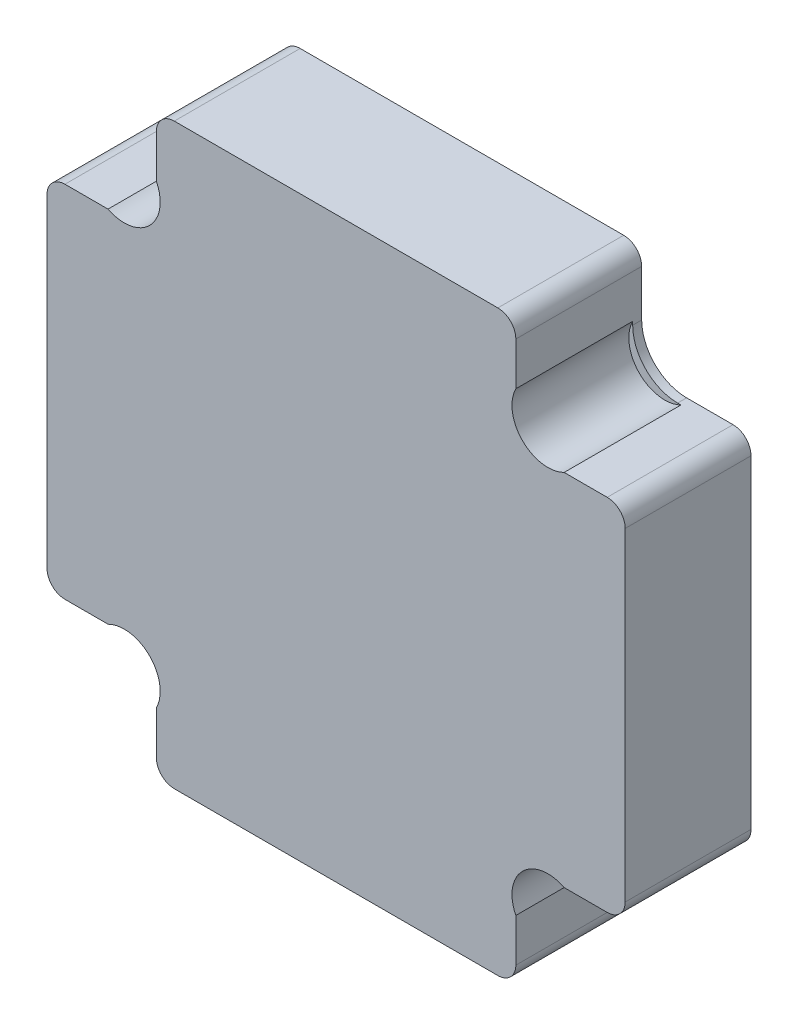
ISO-10303-21;
HEADER;
FILE_DESCRIPTION(('STEP AP214'),'2;1');
FILE_NAME('part.step','',(''),(''),'','','');
FILE_SCHEMA(('AUTOMOTIVE_DESIGN { 1 0 10303 214 1 1 1 1 }'));
ENDSEC;
DATA;
#1=APPLICATION_CONTEXT('core data for automotive mechanical design processes');
#2=APPLICATION_PROTOCOL_DEFINITION('international standard','automotive_design',2000,#1);
#3=PRODUCT_CONTEXT('',#1,'mechanical');
#4=PRODUCT('Part','Part','',(#3));
#5=PRODUCT_RELATED_PRODUCT_CATEGORY('part','',(#4));
#6=PRODUCT_DEFINITION_FORMATION('','',#4);
#7=PRODUCT_DEFINITION_CONTEXT('part definition',#1,'design');
#8=PRODUCT_DEFINITION('design','',#6,#7);
#9=PRODUCT_DEFINITION_SHAPE('','',#8);
#10=(LENGTH_UNIT() NAMED_UNIT(*) SI_UNIT(.MILLI.,.METRE.));
#11=(NAMED_UNIT(*) PLANE_ANGLE_UNIT() SI_UNIT($,.RADIAN.));
#12=(NAMED_UNIT(*) SI_UNIT($,.STERADIAN.) SOLID_ANGLE_UNIT());
#13=UNCERTAINTY_MEASURE_WITH_UNIT(LENGTH_MEASURE(1.E-05),#10,'distance_accuracy_value','');
#14=(GEOMETRIC_REPRESENTATION_CONTEXT(3) GLOBAL_UNCERTAINTY_ASSIGNED_CONTEXT((#13)) GLOBAL_UNIT_ASSIGNED_CONTEXT((#10,
#11,#12)) REPRESENTATION_CONTEXT('',''));
#15=CARTESIAN_POINT('',(0.,0.,0.));
#16=DIRECTION('',(0.,0.,1.));
#17=DIRECTION('',(1.,0.,0.));
#18=AXIS2_PLACEMENT_3D('',#15,#16,#17);
#19=CARTESIAN_POINT('',(0.,0.,-35.5024526321762));
#20=DIRECTION('',(0.,0.,1.));
#21=DIRECTION('',(1.,0.,0.));
#22=AXIS2_PLACEMENT_3D('',#19,#20,#21);
#23=PLANE('',#22);
#24=CARTESIAN_POINT('',(-17.677669529665,17.677669529665,-35.5024526321762));
#25=DIRECTION('',(0.,0.,1.));
#26=DIRECTION('',(1.,0.,0.));
#27=AXIS2_PLACEMENT_3D('',#24,#25,#26);
#28=CIRCLE('',#27,3.);
#29=CARTESIAN_POINT('',(-19.0304762009631,15.,-35.5024526321762));
#30=VERTEX_POINT('',#29);
#31=CARTESIAN_POINT('',(-15.,19.0304762009631,-35.5024526321762));
#32=VERTEX_POINT('',#31);
#33=EDGE_CURVE('E41',#30,#32,#28,.T.);
#34=ORIENTED_EDGE('',*,*,#33,.T.);
#35=DIRECTION('',(0.,1.,0.));
#36=VECTOR('',#35,1.);
#37=CARTESIAN_POINT('',(-15.,24.125,-35.5024526321762));
#38=LINE('',#37,#36);
#39=CARTESIAN_POINT('',(-15.,18.75,-35.5024526321762));
#40=VERTEX_POINT('',#39);
#41=EDGE_CURVE('E273',#40,#32,#38,.T.);
#42=ORIENTED_EDGE('',*,*,#41,.F.);
#43=CARTESIAN_POINT('',(-18.75,18.75,-35.5024526321762));
#44=DIRECTION('',(0.,0.,1.));
#45=DIRECTION('',(1.,0.,0.));
#46=AXIS2_PLACEMENT_3D('',#43,#44,#45);
#47=CIRCLE('',#46,3.75);
#48=CARTESIAN_POINT('',(-18.75,15.,-35.5024526321762));
#49=VERTEX_POINT('',#48);
#50=EDGE_CURVE('E247',#40,#49,#47,.F.);
#51=ORIENTED_EDGE('',*,*,#50,.T.);
#52=DIRECTION('',(1.,0.,0.));
#53=VECTOR('',#52,1.);
#54=CARTESIAN_POINT('',(0.,15.,-35.5024526321762));
#55=LINE('',#54,#53);
#56=EDGE_CURVE('E243',#49,#30,#55,.F.);
#57=ORIENTED_EDGE('',*,*,#56,.T.);
#58=EDGE_LOOP('',(#34,#42,#51,#57));
#59=FACE_BOUND('',#58,.T.);
#60=ADVANCED_FACE('F38',(#59),#23,.T.);
#61=CARTESIAN_POINT('',(-17.677669529665,17.677669529665,-25.7524526321762));
#62=DIRECTION('',(0.,0.,1.));
#63=DIRECTION('',(1.,0.,0.));
#64=AXIS2_PLACEMENT_3D('',#61,#62,#63);
#65=CYLINDRICAL_SURFACE('',#64,3.);
#66=ORIENTED_EDGE('',*,*,#33,.F.);
#67=DIRECTION('',(0.,0.,1.));
#68=VECTOR('',#67,1.);
#69=CARTESIAN_POINT('',(-19.030476200965,15.,-25.7524526321762));
#70=LINE('',#69,#68);
#71=CARTESIAN_POINT('',(-19.0304762009631,15.,-25.7524526321762));
#72=VERTEX_POINT('',#71);
#73=EDGE_CURVE('E256',#72,#30,#70,.F.);
#74=ORIENTED_EDGE('',*,*,#73,.F.);
#75=CARTESIAN_POINT('',(-17.677669529665,17.677669529665,-25.7524526321762));
#76=DIRECTION('',(0.,0.,1.));
#77=DIRECTION('',(1.,0.,0.));
#78=AXIS2_PLACEMENT_3D('',#75,#76,#77);
#79=CIRCLE('',#78,3.);
#80=CARTESIAN_POINT('',(-15.,19.0304762009631,-25.7524526321762));
#81=VERTEX_POINT('',#80);
#82=EDGE_CURVE('E380',#81,#72,#79,.F.);
#83=ORIENTED_EDGE('',*,*,#82,.F.);
#84=DIRECTION('',(0.,0.,1.));
#85=VECTOR('',#84,1.);
#86=CARTESIAN_POINT('',(-15.,19.030476200965,-25.7524526321762));
#87=LINE('',#86,#85);
#88=EDGE_CURVE('E258',#32,#81,#87,.T.);
#89=ORIENTED_EDGE('',*,*,#88,.F.);
#90=EDGE_LOOP('',(#66,#74,#83,#89));
#91=FACE_BOUND('',#90,.T.);
#92=ADVANCED_FACE('F255',(#91),#65,.F.);
#93=CARTESIAN_POINT('',(0.,0.,-35.5024526321762));
#94=DIRECTION('',(0.,0.,1.));
#95=DIRECTION('',(1.,0.,0.));
#96=AXIS2_PLACEMENT_3D('',#93,#94,#95);
#97=PLANE('',#96);
#98=CARTESIAN_POINT('',(-17.677669529665,-17.677669529665,-35.5024526321762));
#99=DIRECTION('',(0.,0.,1.));
#100=DIRECTION('',(1.,0.,0.));
#101=AXIS2_PLACEMENT_3D('',#98,#99,#100);
#102=CIRCLE('',#101,3.);
#103=CARTESIAN_POINT('',(-15.,-19.0304762009631,-35.5024526321762));
#104=VERTEX_POINT('',#103);
#105=CARTESIAN_POINT('',(-19.0304762009631,-15.,-35.5024526321762));
#106=VERTEX_POINT('',#105);
#107=EDGE_CURVE('E385',#104,#106,#102,.T.);
#108=ORIENTED_EDGE('',*,*,#107,.T.);
#109=DIRECTION('',(1.,0.,0.));
#110=VECTOR('',#109,1.);
#111=CARTESIAN_POINT('',(-24.125,-15.,-35.5024526321762));
#112=LINE('',#111,#110);
#113=CARTESIAN_POINT('',(-18.75,-15.,-35.5024526321762));
#114=VERTEX_POINT('',#113);
#115=EDGE_CURVE('E361',#114,#106,#112,.F.);
#116=ORIENTED_EDGE('',*,*,#115,.F.);
#117=CARTESIAN_POINT('',(-18.75,-18.75,-35.5024526321762));
#118=DIRECTION('',(0.,0.,1.));
#119=DIRECTION('',(1.,0.,0.));
#120=AXIS2_PLACEMENT_3D('',#117,#118,#119);
#121=CIRCLE('',#120,3.75);
#122=CARTESIAN_POINT('',(-15.,-18.75,-35.5024526321762));
#123=VERTEX_POINT('',#122);
#124=EDGE_CURVE('E357',#114,#123,#121,.F.);
#125=ORIENTED_EDGE('',*,*,#124,.T.);
#126=DIRECTION('',(0.,1.,0.));
#127=VECTOR('',#126,1.);
#128=CARTESIAN_POINT('',(-15.,0.,-35.5024526321762));
#129=LINE('',#128,#127);
#130=EDGE_CURVE('E259',#123,#104,#129,.F.);
#131=ORIENTED_EDGE('',*,*,#130,.T.);
#132=EDGE_LOOP('',(#108,#116,#125,#131));
#133=FACE_BOUND('',#132,.T.);
#134=ADVANCED_FACE('F588',(#133),#97,.T.);
#135=CARTESIAN_POINT('',(-17.677669529665,-17.677669529665,-25.7524526321762));
#136=DIRECTION('',(0.,0.,1.));
#137=DIRECTION('',(1.,0.,0.));
#138=AXIS2_PLACEMENT_3D('',#135,#136,#137);
#139=CYLINDRICAL_SURFACE('',#138,3.);
#140=ORIENTED_EDGE('',*,*,#107,.F.);
#141=DIRECTION('',(0.,0.,1.));
#142=VECTOR('',#141,1.);
#143=CARTESIAN_POINT('',(-15.,-19.030476200965,-25.7524526321762));
#144=LINE('',#143,#142);
#145=CARTESIAN_POINT('',(-15.,-19.0304762009631,-25.7524526321762));
#146=VERTEX_POINT('',#145);
#147=EDGE_CURVE('E356',#146,#104,#144,.F.);
#148=ORIENTED_EDGE('',*,*,#147,.F.);
#149=CARTESIAN_POINT('',(-17.677669529665,-17.677669529665,-25.7524526321762));
#150=DIRECTION('',(0.,0.,1.));
#151=DIRECTION('',(1.,0.,0.));
#152=AXIS2_PLACEMENT_3D('',#149,#150,#151);
#153=CIRCLE('',#152,3.);
#154=CARTESIAN_POINT('',(-19.0304762009631,-15.,-25.7524526321762));
#155=VERTEX_POINT('',#154);
#156=EDGE_CURVE('E378',#155,#146,#153,.F.);
#157=ORIENTED_EDGE('',*,*,#156,.F.);
#158=DIRECTION('',(0.,0.,-1.));
#159=VECTOR('',#158,1.);
#160=CARTESIAN_POINT('',(-19.030476200965,-15.,-25.7524526321762));
#161=LINE('',#160,#159);
#162=EDGE_CURVE('E395',#106,#155,#161,.F.);
#163=ORIENTED_EDGE('',*,*,#162,.F.);
#164=EDGE_LOOP('',(#140,#148,#157,#163));
#165=FACE_BOUND('',#164,.T.);
#166=ADVANCED_FACE('F458',(#165),#139,.F.);
#167=CARTESIAN_POINT('',(0.,0.,-35.5024526321762));
#168=DIRECTION('',(0.,0.,1.));
#169=DIRECTION('',(1.,0.,0.));
#170=AXIS2_PLACEMENT_3D('',#167,#168,#169);
#171=PLANE('',#170);
#172=DIRECTION('',(1.,0.,0.));
#173=VECTOR('',#172,1.);
#174=CARTESIAN_POINT('',(0.,-15.,-35.5024526321762));
#175=LINE('',#174,#173);
#176=CARTESIAN_POINT('',(18.75,-15.,-35.5024526321762));
#177=VERTEX_POINT('',#176);
#178=CARTESIAN_POINT('',(19.0304762009631,-15.,-35.5024526321762));
#179=VERTEX_POINT('',#178);
#180=EDGE_CURVE('E384',#177,#179,#175,.T.);
#181=ORIENTED_EDGE('',*,*,#180,.T.);
#182=CARTESIAN_POINT('',(17.677669529665,-17.677669529665,-35.5024526321762));
#183=DIRECTION('',(0.,0.,1.));
#184=DIRECTION('',(1.,0.,0.));
#185=AXIS2_PLACEMENT_3D('',#182,#183,#184);
#186=CIRCLE('',#185,3.);
#187=CARTESIAN_POINT('',(15.,-19.0304762009631,-35.5024526321762));
#188=VERTEX_POINT('',#187);
#189=EDGE_CURVE('E383',#179,#188,#186,.T.);
#190=ORIENTED_EDGE('',*,*,#189,.T.);
#191=DIRECTION('',(0.,1.,0.));
#192=VECTOR('',#191,1.);
#193=CARTESIAN_POINT('',(15.,-24.125,-35.5024526321762));
#194=LINE('',#193,#192);
#195=CARTESIAN_POINT('',(15.,-18.75,-35.5024526321762));
#196=VERTEX_POINT('',#195);
#197=EDGE_CURVE('E348',#196,#188,#194,.F.);
#198=ORIENTED_EDGE('',*,*,#197,.F.);
#199=CARTESIAN_POINT('',(18.75,-18.75,-35.5024526321762));
#200=DIRECTION('',(0.,0.,1.));
#201=DIRECTION('',(1.,0.,0.));
#202=AXIS2_PLACEMENT_3D('',#199,#200,#201);
#203=CIRCLE('',#202,3.75);
#204=EDGE_CURVE('E344',#196,#177,#203,.F.);
#205=ORIENTED_EDGE('',*,*,#204,.T.);
#206=EDGE_LOOP('',(#181,#190,#198,#205));
#207=FACE_BOUND('',#206,.T.);
#208=ADVANCED_FACE('F579',(#207),#171,.T.);
#209=CARTESIAN_POINT('',(17.677669529665,-17.677669529665,-25.7524526321762));
#210=DIRECTION('',(0.,0.,1.));
#211=DIRECTION('',(1.,0.,0.));
#212=AXIS2_PLACEMENT_3D('',#209,#210,#211);
#213=CYLINDRICAL_SURFACE('',#212,3.);
#214=CARTESIAN_POINT('',(17.677669529665,-17.677669529665,-25.7524526321762));
#215=DIRECTION('',(0.,0.,1.));
#216=DIRECTION('',(1.,0.,0.));
#217=AXIS2_PLACEMENT_3D('',#214,#215,#216);
#218=CIRCLE('',#217,3.);
#219=CARTESIAN_POINT('',(15.,-19.0304762009631,-25.7524526321762));
#220=VERTEX_POINT('',#219);
#221=CARTESIAN_POINT('',(19.0304762009631,-15.,-25.7524526321762));
#222=VERTEX_POINT('',#221);
#223=EDGE_CURVE('E376',#220,#222,#218,.F.);
#224=ORIENTED_EDGE('',*,*,#223,.F.);
#225=DIRECTION('',(0.,0.,-1.));
#226=VECTOR('',#225,1.);
#227=CARTESIAN_POINT('',(15.,-19.030476200965,-25.7524526321762));
#228=LINE('',#227,#226);
#229=EDGE_CURVE('E442',#188,#220,#228,.F.);
#230=ORIENTED_EDGE('',*,*,#229,.F.);
#231=ORIENTED_EDGE('',*,*,#189,.F.);
#232=DIRECTION('',(0.,0.,-1.));
#233=VECTOR('',#232,1.);
#234=CARTESIAN_POINT('',(19.030476200965,-15.,-25.7524526321762));
#235=LINE('',#234,#233);
#236=EDGE_CURVE('E343',#222,#179,#235,.T.);
#237=ORIENTED_EDGE('',*,*,#236,.F.);
#238=EDGE_LOOP('',(#224,#230,#231,#237));
#239=FACE_BOUND('',#238,.T.);
#240=ADVANCED_FACE('F577',(#239),#213,.F.);
#241=CARTESIAN_POINT('',(0.,0.,-35.5024526321762));
#242=DIRECTION('',(0.,0.,1.));
#243=DIRECTION('',(1.,0.,0.));
#244=AXIS2_PLACEMENT_3D('',#241,#242,#243);
#245=PLANE('',#244);
#246=DIRECTION('',(0.,1.,0.));
#247=VECTOR('',#246,1.);
#248=CARTESIAN_POINT('',(15.,0.,-35.5024526321762));
#249=LINE('',#248,#247);
#250=CARTESIAN_POINT('',(15.,18.75,-35.5024526321762));
#251=VERTEX_POINT('',#250);
#252=CARTESIAN_POINT('',(15.,19.0304762009631,-35.5024526321762));
#253=VERTEX_POINT('',#252);
#254=EDGE_CURVE('E382',#251,#253,#249,.T.);
#255=ORIENTED_EDGE('',*,*,#254,.T.);
#256=CARTESIAN_POINT('',(17.677669529665,17.677669529665,-35.5024526321762));
#257=DIRECTION('',(0.,0.,1.));
#258=DIRECTION('',(1.,0.,0.));
#259=AXIS2_PLACEMENT_3D('',#256,#257,#258);
#260=CIRCLE('',#259,3.);
#261=CARTESIAN_POINT('',(19.0304762009631,15.,-35.5024526321762));
#262=VERTEX_POINT('',#261);
#263=EDGE_CURVE('E374',#253,#262,#260,.T.);
#264=ORIENTED_EDGE('',*,*,#263,.T.);
#265=DIRECTION('',(1.,0.,0.));
#266=VECTOR('',#265,1.);
#267=CARTESIAN_POINT('',(24.125,15.,-35.5024526321762));
#268=LINE('',#267,#266);
#269=CARTESIAN_POINT('',(18.75,15.,-35.5024526321762));
#270=VERTEX_POINT('',#269);
#271=EDGE_CURVE('E335',#270,#262,#268,.T.);
#272=ORIENTED_EDGE('',*,*,#271,.F.);
#273=CARTESIAN_POINT('',(18.75,18.75,-35.5024526321762));
#274=DIRECTION('',(0.,0.,1.));
#275=DIRECTION('',(1.,0.,0.));
#276=AXIS2_PLACEMENT_3D('',#273,#274,#275);
#277=CIRCLE('',#276,3.75);
#278=EDGE_CURVE('E331',#270,#251,#277,.F.);
#279=ORIENTED_EDGE('',*,*,#278,.T.);
#280=EDGE_LOOP('',(#255,#264,#272,#279));
#281=FACE_BOUND('',#280,.T.);
#282=ADVANCED_FACE('F586',(#281),#245,.T.);
#283=CARTESIAN_POINT('',(0.,0.,-25.7524526321762));
#284=DIRECTION('',(0.,0.,1.));
#285=DIRECTION('',(1.,0.,0.));
#286=AXIS2_PLACEMENT_3D('',#283,#284,#285);
#287=PLANE('',#286);
#288=DIRECTION('',(1.,0.,0.));
#289=VECTOR('',#288,1.);
#290=CARTESIAN_POINT('',(24.125,15.,-25.7524526321762));
#291=LINE('',#290,#289);
#292=CARTESIAN_POINT('',(19.0304762009631,15.,-25.7524526321762));
#293=VERTEX_POINT('',#292);
#294=CARTESIAN_POINT('',(22.625,15.,-25.7524526321762));
#295=VERTEX_POINT('',#294);
#296=EDGE_CURVE('E429',#293,#295,#291,.T.);
#297=ORIENTED_EDGE('',*,*,#296,.F.);
#298=CARTESIAN_POINT('',(17.677669529665,17.677669529665,-25.7524526321762));
#299=DIRECTION('',(0.,0.,1.));
#300=DIRECTION('',(1.,0.,0.));
#301=AXIS2_PLACEMENT_3D('',#298,#299,#300);
#302=CIRCLE('',#301,3.);
#303=CARTESIAN_POINT('',(15.,19.0304762009631,-25.7524526321762));
#304=VERTEX_POINT('',#303);
#305=EDGE_CURVE('E371',#293,#304,#302,.F.);
#306=ORIENTED_EDGE('',*,*,#305,.T.);
#307=DIRECTION('',(0.,1.,0.));
#308=VECTOR('',#307,1.);
#309=CARTESIAN_POINT('',(15.,15.,-25.7524526321762));
#310=LINE('',#309,#308);
#311=CARTESIAN_POINT('',(15.,22.625,-25.7524526321762));
#312=VERTEX_POINT('',#311);
#313=EDGE_CURVE('E417',#312,#304,#310,.F.);
#314=ORIENTED_EDGE('',*,*,#313,.F.);
#315=CARTESIAN_POINT('',(13.5,22.625,-25.7524526321762));
#316=DIRECTION('',(0.,0.,-1.));
#317=DIRECTION('',(-1.,0.,0.));
#318=AXIS2_PLACEMENT_3D('',#315,#316,#317);
#319=CIRCLE('',#318,1.5);
#320=CARTESIAN_POINT('',(13.5,24.125,-25.7524526321762));
#321=VERTEX_POINT('',#320);
#322=EDGE_CURVE('E283',#321,#312,#319,.T.);
#323=ORIENTED_EDGE('',*,*,#322,.F.);
#324=DIRECTION('',(1.,0.,0.));
#325=VECTOR('',#324,1.);
#326=CARTESIAN_POINT('',(15.,24.125,-25.7524526321762));
#327=LINE('',#326,#325);
#328=CARTESIAN_POINT('',(-13.5,24.125,-25.7524526321762));
#329=VERTEX_POINT('',#328);
#330=EDGE_CURVE('E280',#329,#321,#327,.T.);
#331=ORIENTED_EDGE('',*,*,#330,.F.);
#332=CARTESIAN_POINT('',(-13.5,22.625,-25.7524526321762));
#333=DIRECTION('',(0.,0.,-1.));
#334=DIRECTION('',(-1.,0.,0.));
#335=AXIS2_PLACEMENT_3D('',#332,#333,#334);
#336=CIRCLE('',#335,1.5);
#337=CARTESIAN_POINT('',(-15.,22.625,-25.7524526321762));
#338=VERTEX_POINT('',#337);
#339=EDGE_CURVE('E368',#338,#329,#336,.T.);
#340=ORIENTED_EDGE('',*,*,#339,.F.);
#341=DIRECTION('',(0.,1.,0.));
#342=VECTOR('',#341,1.);
#343=CARTESIAN_POINT('',(-15.,24.125,-25.7524526321762));
#344=LINE('',#343,#342);
#345=EDGE_CURVE('E277',#81,#338,#344,.T.);
#346=ORIENTED_EDGE('',*,*,#345,.F.);
#347=ORIENTED_EDGE('',*,*,#82,.T.);
#348=DIRECTION('',(1.,0.,0.));
#349=VECTOR('',#348,1.);
#350=CARTESIAN_POINT('',(-15.,15.,-25.7524526321762));
#351=LINE('',#350,#349);
#352=CARTESIAN_POINT('',(-22.625,15.,-25.7524526321762));
#353=VERTEX_POINT('',#352);
#354=EDGE_CURVE('E264',#353,#72,#351,.T.);
#355=ORIENTED_EDGE('',*,*,#354,.F.);
#356=CARTESIAN_POINT('',(-22.625,13.5,-25.7524526321762));
#357=DIRECTION('',(0.,0.,-1.));
#358=DIRECTION('',(-1.,0.,0.));
#359=AXIS2_PLACEMENT_3D('',#356,#357,#358);
#360=CIRCLE('',#359,1.5);
#361=CARTESIAN_POINT('',(-24.125,13.5,-25.7524526321762));
#362=VERTEX_POINT('',#361);
#363=EDGE_CURVE('E265',#362,#353,#360,.T.);
#364=ORIENTED_EDGE('',*,*,#363,.F.);
#365=DIRECTION('',(0.,1.,0.));
#366=VECTOR('',#365,1.);
#367=CARTESIAN_POINT('',(-24.125,15.,-25.7524526321762));
#368=LINE('',#367,#366);
#369=CARTESIAN_POINT('',(-24.125,-13.5,-25.7524526321762));
#370=VERTEX_POINT('',#369);
#371=EDGE_CURVE('E400',#370,#362,#368,.T.);
#372=ORIENTED_EDGE('',*,*,#371,.F.);
#373=CARTESIAN_POINT('',(-22.625,-13.5,-25.7524526321762));
#374=DIRECTION('',(0.,0.,-1.));
#375=DIRECTION('',(-1.,0.,0.));
#376=AXIS2_PLACEMENT_3D('',#373,#374,#375);
#377=CIRCLE('',#376,1.5);
#378=CARTESIAN_POINT('',(-22.625,-15.,-25.7524526321762));
#379=VERTEX_POINT('',#378);
#380=EDGE_CURVE('E362',#379,#370,#377,.T.);
#381=ORIENTED_EDGE('',*,*,#380,.F.);
#382=DIRECTION('',(1.,0.,0.));
#383=VECTOR('',#382,1.);
#384=CARTESIAN_POINT('',(-24.125,-15.,-25.7524526321762));
#385=LINE('',#384,#383);
#386=EDGE_CURVE('E398',#155,#379,#385,.F.);
#387=ORIENTED_EDGE('',*,*,#386,.F.);
#388=ORIENTED_EDGE('',*,*,#156,.T.);
#389=DIRECTION('',(0.,1.,0.));
#390=VECTOR('',#389,1.);
#391=CARTESIAN_POINT('',(-15.,-15.,-25.7524526321762));
#392=LINE('',#391,#390);
#393=CARTESIAN_POINT('',(-15.,-22.625,-25.7524526321762));
#394=VERTEX_POINT('',#393);
#395=EDGE_CURVE('E448',#394,#146,#392,.T.);
#396=ORIENTED_EDGE('',*,*,#395,.F.);
#397=CARTESIAN_POINT('',(-13.5,-22.625,-25.7524526321762));
#398=DIRECTION('',(0.,0.,-1.));
#399=DIRECTION('',(-1.,0.,0.));
#400=AXIS2_PLACEMENT_3D('',#397,#398,#399);
#401=CIRCLE('',#400,1.5);
#402=CARTESIAN_POINT('',(-13.5,-24.125,-25.7524526321762));
#403=VERTEX_POINT('',#402);
#404=EDGE_CURVE('E353',#403,#394,#401,.T.);
#405=ORIENTED_EDGE('',*,*,#404,.F.);
#406=DIRECTION('',(1.,0.,0.));
#407=VECTOR('',#406,1.);
#408=CARTESIAN_POINT('',(-15.,-24.125,-25.7524526321762));
#409=LINE('',#408,#407);
#410=CARTESIAN_POINT('',(13.5,-24.125,-25.7524526321762));
#411=VERTEX_POINT('',#410);
#412=EDGE_CURVE('E446',#411,#403,#409,.F.);
#413=ORIENTED_EDGE('',*,*,#412,.F.);
#414=CARTESIAN_POINT('',(13.5,-22.625,-25.7524526321762));
#415=DIRECTION('',(0.,0.,-1.));
#416=DIRECTION('',(-1.,0.,0.));
#417=AXIS2_PLACEMENT_3D('',#414,#415,#416);
#418=CIRCLE('',#417,1.5);
#419=CARTESIAN_POINT('',(15.,-22.625,-25.7524526321762));
#420=VERTEX_POINT('',#419);
#421=EDGE_CURVE('E349',#420,#411,#418,.T.);
#422=ORIENTED_EDGE('',*,*,#421,.F.);
#423=DIRECTION('',(0.,1.,0.));
#424=VECTOR('',#423,1.);
#425=CARTESIAN_POINT('',(15.,-24.125,-25.7524526321762));
#426=LINE('',#425,#424);
#427=EDGE_CURVE('E444',#220,#420,#426,.F.);
#428=ORIENTED_EDGE('',*,*,#427,.F.);
#429=ORIENTED_EDGE('',*,*,#223,.T.);
#430=DIRECTION('',(1.,0.,0.));
#431=VECTOR('',#430,1.);
#432=CARTESIAN_POINT('',(15.,-15.,-25.7524526321762));
#433=LINE('',#432,#431);
#434=CARTESIAN_POINT('',(22.625,-15.,-25.7524526321762));
#435=VERTEX_POINT('',#434);
#436=EDGE_CURVE('E433',#435,#222,#433,.F.);
#437=ORIENTED_EDGE('',*,*,#436,.F.);
#438=CARTESIAN_POINT('',(22.625,-13.5,-25.7524526321762));
#439=DIRECTION('',(0.,0.,-1.));
#440=DIRECTION('',(-1.,0.,0.));
#441=AXIS2_PLACEMENT_3D('',#438,#439,#440);
#442=CIRCLE('',#441,1.5);
#443=CARTESIAN_POINT('',(24.125,-13.5,-25.7524526321762));
#444=VERTEX_POINT('',#443);
#445=EDGE_CURVE('E340',#444,#435,#442,.T.);
#446=ORIENTED_EDGE('',*,*,#445,.F.);
#447=DIRECTION('',(0.,1.,0.));
#448=VECTOR('',#447,1.);
#449=CARTESIAN_POINT('',(24.125,-15.,-25.7524526321762));
#450=LINE('',#449,#448);
#451=CARTESIAN_POINT('',(24.125,13.5,-25.7524526321762));
#452=VERTEX_POINT('',#451);
#453=EDGE_CURVE('E431',#452,#444,#450,.F.);
#454=ORIENTED_EDGE('',*,*,#453,.F.);
#455=CARTESIAN_POINT('',(22.625,13.5,-25.7524526321762));
#456=DIRECTION('',(0.,0.,-1.));
#457=DIRECTION('',(-1.,0.,0.));
#458=AXIS2_PLACEMENT_3D('',#455,#456,#457);
#459=CIRCLE('',#458,1.5);
#460=EDGE_CURVE('E336',#295,#452,#459,.T.);
#461=ORIENTED_EDGE('',*,*,#460,.F.);
#462=EDGE_LOOP('',(#297,#306,#314,#323,#331,#340,#346,#347,#355,#364,#372,#381,#387,#388,#396,
#405,#413,#422,#428,#429,#437,#446,#454,#461));
#463=FACE_BOUND('',#462,.T.);
#464=ADVANCED_FACE('F467',(#463),#287,.T.);
#465=CARTESIAN_POINT('',(17.677669529665,17.677669529665,-25.7524526321762));
#466=DIRECTION('',(0.,0.,1.));
#467=DIRECTION('',(1.,0.,0.));
#468=AXIS2_PLACEMENT_3D('',#465,#466,#467);
#469=CYLINDRICAL_SURFACE('',#468,3.);
#470=ORIENTED_EDGE('',*,*,#305,.F.);
#471=DIRECTION('',(0.,0.,1.));
#472=VECTOR('',#471,1.);
#473=CARTESIAN_POINT('',(19.030476200965,15.,-25.7524526321762));
#474=LINE('',#473,#472);
#475=EDGE_CURVE('E426',#262,#293,#474,.T.);
#476=ORIENTED_EDGE('',*,*,#475,.F.);
#477=ORIENTED_EDGE('',*,*,#263,.F.);
#478=DIRECTION('',(0.,0.,-1.));
#479=VECTOR('',#478,1.);
#480=CARTESIAN_POINT('',(15.,19.030476200965,-25.7524526321762));
#481=LINE('',#480,#479);
#482=EDGE_CURVE('E330',#304,#253,#481,.T.);
#483=ORIENTED_EDGE('',*,*,#482,.F.);
#484=EDGE_LOOP('',(#470,#476,#477,#483));
#485=FACE_BOUND('',#484,.T.);
#486=ADVANCED_FACE('F656',(#485),#469,.F.);
#487=CARTESIAN_POINT('',(13.5,22.625,-25.6975284824242));
#488=DIRECTION('',(0.,0.,-1.));
#489=DIRECTION('',(-1.,0.,0.));
#490=AXIS2_PLACEMENT_3D('',#487,#488,#489);
#491=CYLINDRICAL_SURFACE('',#490,1.5);
#492=DIRECTION('',(0.,0.,-1.));
#493=VECTOR('',#492,1.);
#494=CARTESIAN_POINT('',(15.,22.625,-25.7524526321762));
#495=LINE('',#494,#493);
#496=CARTESIAN_POINT('',(15.,22.625,-36.2524526321762));
#497=VERTEX_POINT('',#496);
#498=EDGE_CURVE('E419',#497,#312,#495,.F.);
#499=ORIENTED_EDGE('',*,*,#498,.F.);
#500=CARTESIAN_POINT('',(13.5,22.625,-36.2524526321762));
#501=DIRECTION('',(0.,0.,-1.));
#502=DIRECTION('',(-1.,0.,0.));
#503=AXIS2_PLACEMENT_3D('',#500,#501,#502);
#504=CIRCLE('',#503,1.5);
#505=CARTESIAN_POINT('',(13.5,24.125,-36.2524526321762));
#506=VERTEX_POINT('',#505);
#507=EDGE_CURVE('E327',#497,#506,#504,.F.);
#508=ORIENTED_EDGE('',*,*,#507,.T.);
#509=DIRECTION('',(0.,0.,1.));
#510=VECTOR('',#509,1.);
#511=CARTESIAN_POINT('',(13.5,24.125,-25.7524526321762));
#512=LINE('',#511,#510);
#513=EDGE_CURVE('E282',#321,#506,#512,.F.);
#514=ORIENTED_EDGE('',*,*,#513,.F.);
#515=ORIENTED_EDGE('',*,*,#322,.T.);
#516=EDGE_LOOP('',(#499,#508,#514,#515));
#517=FACE_BOUND('',#516,.T.);
#518=ADVANCED_FACE('F652',(#517),#491,.T.);
#519=CARTESIAN_POINT('',(15.,24.125,-25.7524526321762));
#520=DIRECTION('',(0.,1.,0.));
#521=DIRECTION('',(0.,0.,1.));
#522=AXIS2_PLACEMENT_3D('',#519,#520,#521);
#523=PLANE('',#522);
#524=ORIENTED_EDGE('',*,*,#330,.T.);
#525=ORIENTED_EDGE('',*,*,#513,.T.);
#526=DIRECTION('',(1.,0.,0.));
#527=VECTOR('',#526,1.);
#528=CARTESIAN_POINT('',(0.,24.125,-36.2524526321762));
#529=LINE('',#528,#527);
#530=CARTESIAN_POINT('',(-13.5,24.125,-36.2524526321762));
#531=VERTEX_POINT('',#530);
#532=EDGE_CURVE('E326',#506,#531,#529,.F.);
#533=ORIENTED_EDGE('',*,*,#532,.T.);
#534=DIRECTION('',(0.,0.,-1.));
#535=VECTOR('',#534,1.);
#536=CARTESIAN_POINT('',(-13.5,24.125,-25.6975284824242));
#537=LINE('',#536,#535);
#538=EDGE_CURVE('E278',#329,#531,#537,.T.);
#539=ORIENTED_EDGE('',*,*,#538,.F.);
#540=EDGE_LOOP('',(#524,#525,#533,#539));
#541=FACE_BOUND('',#540,.T.);
#542=ADVANCED_FACE('F648',(#541),#523,.T.);
#543=CARTESIAN_POINT('',(-13.5,22.625,-25.6975284824242));
#544=DIRECTION('',(0.,0.,-1.));
#545=DIRECTION('',(-1.,0.,0.));
#546=AXIS2_PLACEMENT_3D('',#543,#544,#545);
#547=CYLINDRICAL_SURFACE('',#546,1.5);
#548=ORIENTED_EDGE('',*,*,#538,.T.);
#549=CARTESIAN_POINT('',(-13.5,22.625,-36.2524526321762));
#550=DIRECTION('',(0.,0.,-1.));
#551=DIRECTION('',(-1.,0.,0.));
#552=AXIS2_PLACEMENT_3D('',#549,#550,#551);
#553=CIRCLE('',#552,1.5);
#554=CARTESIAN_POINT('',(-15.,22.625,-36.2524526321762));
#555=VERTEX_POINT('',#554);
#556=EDGE_CURVE('E323',#531,#555,#553,.F.);
#557=ORIENTED_EDGE('',*,*,#556,.T.);
#558=DIRECTION('',(0.,0.,1.));
#559=VECTOR('',#558,1.);
#560=CARTESIAN_POINT('',(-15.,22.625,-25.7524526321762));
#561=LINE('',#560,#559);
#562=EDGE_CURVE('E274',#338,#555,#561,.F.);
#563=ORIENTED_EDGE('',*,*,#562,.F.);
#564=ORIENTED_EDGE('',*,*,#339,.T.);
#565=EDGE_LOOP('',(#548,#557,#563,#564));
#566=FACE_BOUND('',#565,.T.);
#567=ADVANCED_FACE('F644',(#566),#547,.T.);
#568=CARTESIAN_POINT('',(-15.,24.125,-25.7524526321762));
#569=DIRECTION('',(-1.,0.,0.));
#570=DIRECTION('',(0.,0.,1.));
#571=AXIS2_PLACEMENT_3D('',#568,#569,#570);
#572=PLANE('',#571);
#573=DIRECTION('',(0.,0.,1.));
#574=VECTOR('',#573,1.);
#575=CARTESIAN_POINT('',(-15.,18.75,-36.2993824539962));
#576=LINE('',#575,#574);
#577=CARTESIAN_POINT('',(-15.,18.75,-36.2524526321762));
#578=VERTEX_POINT('',#577);
#579=EDGE_CURVE('E367',#578,#40,#576,.T.);
#580=ORIENTED_EDGE('',*,*,#579,.T.);
#581=ORIENTED_EDGE('',*,*,#41,.T.);
#582=ORIENTED_EDGE('',*,*,#88,.T.);
#583=ORIENTED_EDGE('',*,*,#345,.T.);
#584=ORIENTED_EDGE('',*,*,#562,.T.);
#585=DIRECTION('',(0.,1.,0.));
#586=VECTOR('',#585,1.);
#587=CARTESIAN_POINT('',(-15.,0.,-36.2524526321762));
#588=LINE('',#587,#586);
#589=EDGE_CURVE('E322',#555,#578,#588,.F.);
#590=ORIENTED_EDGE('',*,*,#589,.T.);
#591=EDGE_LOOP('',(#580,#581,#582,#583,#584,#590));
#592=FACE_BOUND('',#591,.T.);
#593=ADVANCED_FACE('F640',(#592),#572,.T.);
#594=CARTESIAN_POINT('',(-18.75,18.75,-36.2993824539962));
#595=DIRECTION('',(0.,0.,1.));
#596=DIRECTION('',(1.,0.,0.));
#597=AXIS2_PLACEMENT_3D('',#594,#595,#596);
#598=CYLINDRICAL_SURFACE('',#597,3.75);
#599=CARTESIAN_POINT('',(-18.75,18.75,-36.2524526321762));
#600=DIRECTION('',(0.,0.,1.));
#601=DIRECTION('',(1.,0.,0.));
#602=AXIS2_PLACEMENT_3D('',#599,#600,#601);
#603=CIRCLE('',#602,3.75);
#604=CARTESIAN_POINT('',(-18.75,15.,-36.2524526321762));
#605=VERTEX_POINT('',#604);
#606=EDGE_CURVE('E319',#578,#605,#603,.F.);
#607=ORIENTED_EDGE('',*,*,#606,.T.);
#608=DIRECTION('',(0.,0.,1.));
#609=VECTOR('',#608,1.);
#610=CARTESIAN_POINT('',(-18.75,15.,-25.7524526321762));
#611=LINE('',#610,#609);
#612=EDGE_CURVE('E269',#49,#605,#611,.F.);
#613=ORIENTED_EDGE('',*,*,#612,.F.);
#614=ORIENTED_EDGE('',*,*,#50,.F.);
#615=ORIENTED_EDGE('',*,*,#579,.F.);
#616=EDGE_LOOP('',(#607,#613,#614,#615));
#617=FACE_BOUND('',#616,.T.);
#618=ADVANCED_FACE('F637',(#617),#598,.F.);
#619=CARTESIAN_POINT('',(-15.,15.,-25.7524526321762));
#620=DIRECTION('',(0.,1.,0.));
#621=DIRECTION('',(0.,0.,1.));
#622=AXIS2_PLACEMENT_3D('',#619,#620,#621);
#623=PLANE('',#622);
#624=ORIENTED_EDGE('',*,*,#73,.T.);
#625=ORIENTED_EDGE('',*,*,#56,.F.);
#626=ORIENTED_EDGE('',*,*,#612,.T.);
#627=DIRECTION('',(1.,0.,0.));
#628=VECTOR('',#627,1.);
#629=CARTESIAN_POINT('',(0.,15.,-36.2524526321762));
#630=LINE('',#629,#628);
#631=CARTESIAN_POINT('',(-22.625,15.,-36.2524526321762));
#632=VERTEX_POINT('',#631);
#633=EDGE_CURVE('E318',#605,#632,#630,.F.);
#634=ORIENTED_EDGE('',*,*,#633,.T.);
#635=DIRECTION('',(0.,0.,-1.));
#636=VECTOR('',#635,1.);
#637=CARTESIAN_POINT('',(-22.625,15.,-25.6975284824242));
#638=LINE('',#637,#636);
#639=EDGE_CURVE('E267',#353,#632,#638,.T.);
#640=ORIENTED_EDGE('',*,*,#639,.F.);
#641=ORIENTED_EDGE('',*,*,#354,.T.);
#642=EDGE_LOOP('',(#624,#625,#626,#634,#640,#641));
#643=FACE_BOUND('',#642,.T.);
#644=ADVANCED_FACE('F261',(#643),#623,.T.);
#645=CARTESIAN_POINT('',(-22.625,13.5,-25.6975284824242));
#646=DIRECTION('',(0.,0.,-1.));
#647=DIRECTION('',(-1.,0.,0.));
#648=AXIS2_PLACEMENT_3D('',#645,#646,#647);
#649=CYLINDRICAL_SURFACE('',#648,1.5);
#650=ORIENTED_EDGE('',*,*,#639,.T.);
#651=CARTESIAN_POINT('',(-22.625,13.5,-36.2524526321762));
#652=DIRECTION('',(0.,0.,-1.));
#653=DIRECTION('',(-1.,0.,0.));
#654=AXIS2_PLACEMENT_3D('',#651,#652,#653);
#655=CIRCLE('',#654,1.5);
#656=CARTESIAN_POINT('',(-24.125,13.5,-36.2524526321762));
#657=VERTEX_POINT('',#656);
#658=EDGE_CURVE('E315',#632,#657,#655,.F.);
#659=ORIENTED_EDGE('',*,*,#658,.T.);
#660=DIRECTION('',(0.,0.,1.));
#661=VECTOR('',#660,1.);
#662=CARTESIAN_POINT('',(-24.125,13.5,-25.7524526321762));
#663=LINE('',#662,#661);
#664=EDGE_CURVE('E364',#362,#657,#663,.F.);
#665=ORIENTED_EDGE('',*,*,#664,.F.);
#666=ORIENTED_EDGE('',*,*,#363,.T.);
#667=EDGE_LOOP('',(#650,#659,#665,#666));
#668=FACE_BOUND('',#667,.T.);
#669=ADVANCED_FACE('F632',(#668),#649,.T.);
#670=CARTESIAN_POINT('',(-24.125,15.,-25.7524526321762));
#671=DIRECTION('',(-1.,0.,0.));
#672=DIRECTION('',(0.,0.,1.));
#673=AXIS2_PLACEMENT_3D('',#670,#671,#672);
#674=PLANE('',#673);
#675=ORIENTED_EDGE('',*,*,#371,.T.);
#676=ORIENTED_EDGE('',*,*,#664,.T.);
#677=DIRECTION('',(0.,1.,0.));
#678=VECTOR('',#677,1.);
#679=CARTESIAN_POINT('',(-24.125,0.,-36.2524526321762));
#680=LINE('',#679,#678);
#681=CARTESIAN_POINT('',(-24.125,-13.5,-36.2524526321762));
#682=VERTEX_POINT('',#681);
#683=EDGE_CURVE('E314',#657,#682,#680,.F.);
#684=ORIENTED_EDGE('',*,*,#683,.T.);
#685=DIRECTION('',(0.,0.,-1.));
#686=VECTOR('',#685,1.);
#687=CARTESIAN_POINT('',(-24.125,-13.5,-25.6975284824242));
#688=LINE('',#687,#686);
#689=EDGE_CURVE('E363',#370,#682,#688,.T.);
#690=ORIENTED_EDGE('',*,*,#689,.F.);
#691=EDGE_LOOP('',(#675,#676,#684,#690));
#692=FACE_BOUND('',#691,.T.);
#693=ADVANCED_FACE('F483',(#692),#674,.T.);
#694=CARTESIAN_POINT('',(-22.625,-13.5,-25.6975284824242));
#695=DIRECTION('',(0.,0.,-1.));
#696=DIRECTION('',(-1.,0.,0.));
#697=AXIS2_PLACEMENT_3D('',#694,#695,#696);
#698=CYLINDRICAL_SURFACE('',#697,1.5);
#699=ORIENTED_EDGE('',*,*,#689,.T.);
#700=CARTESIAN_POINT('',(-22.625,-13.5,-36.2524526321762));
#701=DIRECTION('',(0.,0.,-1.));
#702=DIRECTION('',(-1.,0.,0.));
#703=AXIS2_PLACEMENT_3D('',#700,#701,#702);
#704=CIRCLE('',#703,1.5);
#705=CARTESIAN_POINT('',(-22.625,-15.,-36.2524526321762));
#706=VERTEX_POINT('',#705);
#707=EDGE_CURVE('E311',#682,#706,#704,.F.);
#708=ORIENTED_EDGE('',*,*,#707,.T.);
#709=DIRECTION('',(0.,0.,-1.));
#710=VECTOR('',#709,1.);
#711=CARTESIAN_POINT('',(-22.625,-15.,-25.7524526321762));
#712=LINE('',#711,#710);
#713=EDGE_CURVE('E399',#379,#706,#712,.T.);
#714=ORIENTED_EDGE('',*,*,#713,.F.);
#715=ORIENTED_EDGE('',*,*,#380,.T.);
#716=EDGE_LOOP('',(#699,#708,#714,#715));
#717=FACE_BOUND('',#716,.T.);
#718=ADVANCED_FACE('F470',(#717),#698,.T.);
#719=CARTESIAN_POINT('',(-24.125,-15.,-25.7524526321762));
#720=DIRECTION('',(0.,-1.,0.));
#721=DIRECTION('',(0.,0.,-1.));
#722=AXIS2_PLACEMENT_3D('',#719,#720,#721);
#723=PLANE('',#722);
#724=DIRECTION('',(0.,0.,1.));
#725=VECTOR('',#724,1.);
#726=CARTESIAN_POINT('',(-18.75,-15.,-36.2993824539962));
#727=LINE('',#726,#725);
#728=CARTESIAN_POINT('',(-18.75,-15.,-36.2524526321762));
#729=VERTEX_POINT('',#728);
#730=EDGE_CURVE('E360',#729,#114,#727,.T.);
#731=ORIENTED_EDGE('',*,*,#730,.T.);
#732=ORIENTED_EDGE('',*,*,#115,.T.);
#733=ORIENTED_EDGE('',*,*,#162,.T.);
#734=ORIENTED_EDGE('',*,*,#386,.T.);
#735=ORIENTED_EDGE('',*,*,#713,.T.);
#736=DIRECTION('',(1.,0.,0.));
#737=VECTOR('',#736,1.);
#738=CARTESIAN_POINT('',(0.,-15.,-36.2524526321762));
#739=LINE('',#738,#737);
#740=EDGE_CURVE('E310',#706,#729,#739,.T.);
#741=ORIENTED_EDGE('',*,*,#740,.T.);
#742=EDGE_LOOP('',(#731,#732,#733,#734,#735,#741));
#743=FACE_BOUND('',#742,.T.);
#744=ADVANCED_FACE('F463',(#743),#723,.T.);
#745=CARTESIAN_POINT('',(-18.75,-18.75,-36.2993824539962));
#746=DIRECTION('',(0.,0.,1.));
#747=DIRECTION('',(1.,0.,0.));
#748=AXIS2_PLACEMENT_3D('',#745,#746,#747);
#749=CYLINDRICAL_SURFACE('',#748,3.75);
#750=CARTESIAN_POINT('',(-18.75,-18.75,-36.2524526321762));
#751=DIRECTION('',(0.,0.,1.));
#752=DIRECTION('',(1.,0.,0.));
#753=AXIS2_PLACEMENT_3D('',#750,#751,#752);
#754=CIRCLE('',#753,3.75);
#755=CARTESIAN_POINT('',(-15.,-18.75,-36.2524526321762));
#756=VERTEX_POINT('',#755);
#757=EDGE_CURVE('E307',#729,#756,#754,.F.);
#758=ORIENTED_EDGE('',*,*,#757,.T.);
#759=DIRECTION('',(0.,0.,1.));
#760=VECTOR('',#759,1.);
#761=CARTESIAN_POINT('',(-15.,-18.75,-25.7524526321762));
#762=LINE('',#761,#760);
#763=EDGE_CURVE('E450',#123,#756,#762,.F.);
#764=ORIENTED_EDGE('',*,*,#763,.F.);
#765=ORIENTED_EDGE('',*,*,#124,.F.);
#766=ORIENTED_EDGE('',*,*,#730,.F.);
#767=EDGE_LOOP('',(#758,#764,#765,#766));
#768=FACE_BOUND('',#767,.T.);
#769=ADVANCED_FACE('F514',(#768),#749,.F.);
#770=CARTESIAN_POINT('',(-15.,-15.,-25.7524526321762));
#771=DIRECTION('',(-1.,0.,0.));
#772=DIRECTION('',(0.,0.,1.));
#773=AXIS2_PLACEMENT_3D('',#770,#771,#772);
#774=PLANE('',#773);
#775=ORIENTED_EDGE('',*,*,#147,.T.);
#776=ORIENTED_EDGE('',*,*,#130,.F.);
#777=ORIENTED_EDGE('',*,*,#763,.T.);
#778=DIRECTION('',(0.,1.,0.));
#779=VECTOR('',#778,1.);
#780=CARTESIAN_POINT('',(-15.,0.,-36.2524526321762));
#781=LINE('',#780,#779);
#782=CARTESIAN_POINT('',(-15.,-22.625,-36.2524526321762));
#783=VERTEX_POINT('',#782);
#784=EDGE_CURVE('E306',#756,#783,#781,.F.);
#785=ORIENTED_EDGE('',*,*,#784,.T.);
#786=DIRECTION('',(0.,0.,-1.));
#787=VECTOR('',#786,1.);
#788=CARTESIAN_POINT('',(-15.,-22.625,-25.6975284824242));
#789=LINE('',#788,#787);
#790=EDGE_CURVE('E355',#394,#783,#789,.T.);
#791=ORIENTED_EDGE('',*,*,#790,.F.);
#792=ORIENTED_EDGE('',*,*,#395,.T.);
#793=EDGE_LOOP('',(#775,#776,#777,#785,#791,#792));
#794=FACE_BOUND('',#793,.T.);
#795=ADVANCED_FACE('F454',(#794),#774,.T.);
#796=CARTESIAN_POINT('',(-13.5,-22.625,-25.6975284824242));
#797=DIRECTION('',(0.,0.,-1.));
#798=DIRECTION('',(-1.,0.,0.));
#799=AXIS2_PLACEMENT_3D('',#796,#797,#798);
#800=CYLINDRICAL_SURFACE('',#799,1.5);
#801=ORIENTED_EDGE('',*,*,#790,.T.);
#802=CARTESIAN_POINT('',(-13.5,-22.625,-36.2524526321762));
#803=DIRECTION('',(0.,0.,-1.));
#804=DIRECTION('',(-1.,0.,0.));
#805=AXIS2_PLACEMENT_3D('',#802,#803,#804);
#806=CIRCLE('',#805,1.5);
#807=CARTESIAN_POINT('',(-13.5,-24.125,-36.2524526321762));
#808=VERTEX_POINT('',#807);
#809=EDGE_CURVE('E303',#783,#808,#806,.F.);
#810=ORIENTED_EDGE('',*,*,#809,.T.);
#811=DIRECTION('',(0.,0.,-1.));
#812=VECTOR('',#811,1.);
#813=CARTESIAN_POINT('',(-13.5,-24.125,-25.7524526321762));
#814=LINE('',#813,#812);
#815=EDGE_CURVE('E352',#403,#808,#814,.T.);
#816=ORIENTED_EDGE('',*,*,#815,.F.);
#817=ORIENTED_EDGE('',*,*,#404,.T.);
#818=EDGE_LOOP('',(#801,#810,#816,#817));
#819=FACE_BOUND('',#818,.T.);
#820=ADVANCED_FACE('F572',(#819),#800,.T.);
#821=CARTESIAN_POINT('',(-15.,-24.125,-25.7524526321762));
#822=DIRECTION('',(0.,-1.,0.));
#823=DIRECTION('',(0.,0.,-1.));
#824=AXIS2_PLACEMENT_3D('',#821,#822,#823);
#825=PLANE('',#824);
#826=ORIENTED_EDGE('',*,*,#412,.T.);
#827=ORIENTED_EDGE('',*,*,#815,.T.);
#828=DIRECTION('',(1.,0.,0.));
#829=VECTOR('',#828,1.);
#830=CARTESIAN_POINT('',(0.,-24.125,-36.2524526321762));
#831=LINE('',#830,#829);
#832=CARTESIAN_POINT('',(13.5,-24.125,-36.2524526321762));
#833=VERTEX_POINT('',#832);
#834=EDGE_CURVE('E302',#808,#833,#831,.T.);
#835=ORIENTED_EDGE('',*,*,#834,.T.);
#836=DIRECTION('',(0.,0.,-1.));
#837=VECTOR('',#836,1.);
#838=CARTESIAN_POINT('',(13.5,-24.125,-25.6975284824242));
#839=LINE('',#838,#837);
#840=EDGE_CURVE('E351',#411,#833,#839,.T.);
#841=ORIENTED_EDGE('',*,*,#840,.F.);
#842=EDGE_LOOP('',(#826,#827,#835,#841));
#843=FACE_BOUND('',#842,.T.);
#844=ADVANCED_FACE('F568',(#843),#825,.T.);
#845=CARTESIAN_POINT('',(13.5,-22.625,-25.6975284824242));
#846=DIRECTION('',(0.,0.,-1.));
#847=DIRECTION('',(-1.,0.,0.));
#848=AXIS2_PLACEMENT_3D('',#845,#846,#847);
#849=CYLINDRICAL_SURFACE('',#848,1.5);
#850=ORIENTED_EDGE('',*,*,#840,.T.);
#851=CARTESIAN_POINT('',(13.5,-22.625,-36.2524526321762));
#852=DIRECTION('',(0.,0.,-1.));
#853=DIRECTION('',(-1.,0.,0.));
#854=AXIS2_PLACEMENT_3D('',#851,#852,#853);
#855=CIRCLE('',#854,1.5);
#856=CARTESIAN_POINT('',(15.,-22.625,-36.2524526321762));
#857=VERTEX_POINT('',#856);
#858=EDGE_CURVE('E299',#833,#857,#855,.F.);
#859=ORIENTED_EDGE('',*,*,#858,.T.);
#860=DIRECTION('',(0.,0.,-1.));
#861=VECTOR('',#860,1.);
#862=CARTESIAN_POINT('',(15.,-22.625,-25.7524526321762));
#863=LINE('',#862,#861);
#864=EDGE_CURVE('E440',#420,#857,#863,.T.);
#865=ORIENTED_EDGE('',*,*,#864,.F.);
#866=ORIENTED_EDGE('',*,*,#421,.T.);
#867=EDGE_LOOP('',(#850,#859,#865,#866));
#868=FACE_BOUND('',#867,.T.);
#869=ADVANCED_FACE('F563',(#868),#849,.T.);
#870=CARTESIAN_POINT('',(15.,-24.125,-25.7524526321762));
#871=DIRECTION('',(1.,0.,0.));
#872=DIRECTION('',(0.,0.,-1.));
#873=AXIS2_PLACEMENT_3D('',#870,#871,#872);
#874=PLANE('',#873);
#875=DIRECTION('',(0.,0.,1.));
#876=VECTOR('',#875,1.);
#877=CARTESIAN_POINT('',(15.,-18.75,-36.2993824539962));
#878=LINE('',#877,#876);
#879=CARTESIAN_POINT('',(15.,-18.75,-36.2524526321762));
#880=VERTEX_POINT('',#879);
#881=EDGE_CURVE('E347',#880,#196,#878,.T.);
#882=ORIENTED_EDGE('',*,*,#881,.T.);
#883=ORIENTED_EDGE('',*,*,#197,.T.);
#884=ORIENTED_EDGE('',*,*,#229,.T.);
#885=ORIENTED_EDGE('',*,*,#427,.T.);
#886=ORIENTED_EDGE('',*,*,#864,.T.);
#887=DIRECTION('',(0.,1.,0.));
#888=VECTOR('',#887,1.);
#889=CARTESIAN_POINT('',(15.,0.,-36.2524526321762));
#890=LINE('',#889,#888);
#891=EDGE_CURVE('E298',#857,#880,#890,.T.);
#892=ORIENTED_EDGE('',*,*,#891,.T.);
#893=EDGE_LOOP('',(#882,#883,#884,#885,#886,#892));
#894=FACE_BOUND('',#893,.T.);
#895=ADVANCED_FACE('F558',(#894),#874,.T.);
#896=CARTESIAN_POINT('',(18.75,-18.75,-36.2993824539962));
#897=DIRECTION('',(0.,0.,1.));
#898=DIRECTION('',(1.,0.,0.));
#899=AXIS2_PLACEMENT_3D('',#896,#897,#898);
#900=CYLINDRICAL_SURFACE('',#899,3.75);
#901=CARTESIAN_POINT('',(18.75,-18.75,-36.2524526321762));
#902=DIRECTION('',(0.,0.,1.));
#903=DIRECTION('',(1.,0.,0.));
#904=AXIS2_PLACEMENT_3D('',#901,#902,#903);
#905=CIRCLE('',#904,3.75);
#906=CARTESIAN_POINT('',(18.75,-15.,-36.2524526321762));
#907=VERTEX_POINT('',#906);
#908=EDGE_CURVE('E295',#880,#907,#905,.F.);
#909=ORIENTED_EDGE('',*,*,#908,.T.);
#910=DIRECTION('',(0.,0.,-1.));
#911=VECTOR('',#910,1.);
#912=CARTESIAN_POINT('',(18.75,-15.,-25.7524526321762));
#913=LINE('',#912,#911);
#914=EDGE_CURVE('E436',#177,#907,#913,.T.);
#915=ORIENTED_EDGE('',*,*,#914,.F.);
#916=ORIENTED_EDGE('',*,*,#204,.F.);
#917=ORIENTED_EDGE('',*,*,#881,.F.);
#918=EDGE_LOOP('',(#909,#915,#916,#917));
#919=FACE_BOUND('',#918,.T.);
#920=ADVANCED_FACE('F555',(#919),#900,.F.);
#921=CARTESIAN_POINT('',(15.,-15.,-25.7524526321762));
#922=DIRECTION('',(0.,-1.,0.));
#923=DIRECTION('',(0.,0.,-1.));
#924=AXIS2_PLACEMENT_3D('',#921,#922,#923);
#925=PLANE('',#924);
#926=ORIENTED_EDGE('',*,*,#236,.T.);
#927=ORIENTED_EDGE('',*,*,#180,.F.);
#928=ORIENTED_EDGE('',*,*,#914,.T.);
#929=DIRECTION('',(1.,0.,0.));
#930=VECTOR('',#929,1.);
#931=CARTESIAN_POINT('',(0.,-15.,-36.2524526321762));
#932=LINE('',#931,#930);
#933=CARTESIAN_POINT('',(22.625,-15.,-36.2524526321762));
#934=VERTEX_POINT('',#933);
#935=EDGE_CURVE('E294',#907,#934,#932,.T.);
#936=ORIENTED_EDGE('',*,*,#935,.T.);
#937=DIRECTION('',(0.,0.,-1.));
#938=VECTOR('',#937,1.);
#939=CARTESIAN_POINT('',(22.625,-15.,-25.6975284824242));
#940=LINE('',#939,#938);
#941=EDGE_CURVE('E342',#435,#934,#940,.T.);
#942=ORIENTED_EDGE('',*,*,#941,.F.);
#943=ORIENTED_EDGE('',*,*,#436,.T.);
#944=EDGE_LOOP('',(#926,#927,#928,#936,#942,#943));
#945=FACE_BOUND('',#944,.T.);
#946=ADVANCED_FACE('F549',(#945),#925,.T.);
#947=CARTESIAN_POINT('',(22.625,-13.5,-25.6975284824242));
#948=DIRECTION('',(0.,0.,-1.));
#949=DIRECTION('',(-1.,0.,0.));
#950=AXIS2_PLACEMENT_3D('',#947,#948,#949);
#951=CYLINDRICAL_SURFACE('',#950,1.5);
#952=ORIENTED_EDGE('',*,*,#941,.T.);
#953=CARTESIAN_POINT('',(22.625,-13.5,-36.2524526321762));
#954=DIRECTION('',(0.,0.,-1.));
#955=DIRECTION('',(-1.,0.,0.));
#956=AXIS2_PLACEMENT_3D('',#953,#954,#955);
#957=CIRCLE('',#956,1.5);
#958=CARTESIAN_POINT('',(24.125,-13.5,-36.2524526321762));
#959=VERTEX_POINT('',#958);
#960=EDGE_CURVE('E291',#934,#959,#957,.F.);
#961=ORIENTED_EDGE('',*,*,#960,.T.);
#962=DIRECTION('',(0.,0.,-1.));
#963=VECTOR('',#962,1.);
#964=CARTESIAN_POINT('',(24.125,-13.5,-25.7524526321762));
#965=LINE('',#964,#963);
#966=EDGE_CURVE('E339',#444,#959,#965,.T.);
#967=ORIENTED_EDGE('',*,*,#966,.F.);
#968=ORIENTED_EDGE('',*,*,#445,.T.);
#969=EDGE_LOOP('',(#952,#961,#967,#968));
#970=FACE_BOUND('',#969,.T.);
#971=ADVANCED_FACE('F545',(#970),#951,.T.);
#972=CARTESIAN_POINT('',(24.125,-15.,-25.7524526321762));
#973=DIRECTION('',(1.,0.,0.));
#974=DIRECTION('',(0.,0.,-1.));
#975=AXIS2_PLACEMENT_3D('',#972,#973,#974);
#976=PLANE('',#975);
#977=ORIENTED_EDGE('',*,*,#453,.T.);
#978=ORIENTED_EDGE('',*,*,#966,.T.);
#979=DIRECTION('',(0.,1.,0.));
#980=VECTOR('',#979,1.);
#981=CARTESIAN_POINT('',(24.125,0.,-36.2524526321762));
#982=LINE('',#981,#980);
#983=CARTESIAN_POINT('',(24.125,13.5,-36.2524526321762));
#984=VERTEX_POINT('',#983);
#985=EDGE_CURVE('E290',#959,#984,#982,.T.);
#986=ORIENTED_EDGE('',*,*,#985,.T.);
#987=DIRECTION('',(0.,0.,-1.));
#988=VECTOR('',#987,1.);
#989=CARTESIAN_POINT('',(24.125,13.5,-25.6975284824242));
#990=LINE('',#989,#988);
#991=EDGE_CURVE('E338',#452,#984,#990,.T.);
#992=ORIENTED_EDGE('',*,*,#991,.F.);
#993=EDGE_LOOP('',(#977,#978,#986,#992));
#994=FACE_BOUND('',#993,.T.);
#995=ADVANCED_FACE('F539',(#994),#976,.T.);
#996=CARTESIAN_POINT('',(22.625,13.5,-25.6975284824242));
#997=DIRECTION('',(0.,0.,-1.));
#998=DIRECTION('',(-1.,0.,0.));
#999=AXIS2_PLACEMENT_3D('',#996,#997,#998);
#1000=CYLINDRICAL_SURFACE('',#999,1.5);
#1001=ORIENTED_EDGE('',*,*,#991,.T.);
#1002=CARTESIAN_POINT('',(22.625,13.5,-36.2524526321762));
#1003=DIRECTION('',(0.,0.,-1.));
#1004=DIRECTION('',(-1.,0.,0.));
#1005=AXIS2_PLACEMENT_3D('',#1002,#1003,#1004);
#1006=CIRCLE('',#1005,1.5);
#1007=CARTESIAN_POINT('',(22.625,15.,-36.2524526321762));
#1008=VERTEX_POINT('',#1007);
#1009=EDGE_CURVE('E287',#984,#1008,#1006,.F.);
#1010=ORIENTED_EDGE('',*,*,#1009,.T.);
#1011=DIRECTION('',(0.,0.,1.));
#1012=VECTOR('',#1011,1.);
#1013=CARTESIAN_POINT('',(22.625,15.,-25.7524526321762));
#1014=LINE('',#1013,#1012);
#1015=EDGE_CURVE('E424',#295,#1008,#1014,.F.);
#1016=ORIENTED_EDGE('',*,*,#1015,.F.);
#1017=ORIENTED_EDGE('',*,*,#460,.T.);
#1018=EDGE_LOOP('',(#1001,#1010,#1016,#1017));
#1019=FACE_BOUND('',#1018,.T.);
#1020=ADVANCED_FACE('F534',(#1019),#1000,.T.);
#1021=CARTESIAN_POINT('',(24.125,15.,-25.7524526321762));
#1022=DIRECTION('',(0.,1.,0.));
#1023=DIRECTION('',(0.,0.,1.));
#1024=AXIS2_PLACEMENT_3D('',#1021,#1022,#1023);
#1025=PLANE('',#1024);
#1026=DIRECTION('',(0.,0.,1.));
#1027=VECTOR('',#1026,1.);
#1028=CARTESIAN_POINT('',(18.75,15.,-36.2993824539962));
#1029=LINE('',#1028,#1027);
#1030=CARTESIAN_POINT('',(18.75,15.,-36.2524526321762));
#1031=VERTEX_POINT('',#1030);
#1032=EDGE_CURVE('E334',#1031,#270,#1029,.T.);
#1033=ORIENTED_EDGE('',*,*,#1032,.T.);
#1034=ORIENTED_EDGE('',*,*,#271,.T.);
#1035=ORIENTED_EDGE('',*,*,#475,.T.);
#1036=ORIENTED_EDGE('',*,*,#296,.T.);
#1037=ORIENTED_EDGE('',*,*,#1015,.T.);
#1038=DIRECTION('',(1.,0.,0.));
#1039=VECTOR('',#1038,1.);
#1040=CARTESIAN_POINT('',(0.,15.,-36.2524526321762));
#1041=LINE('',#1040,#1039);
#1042=EDGE_CURVE('E286',#1008,#1031,#1041,.F.);
#1043=ORIENTED_EDGE('',*,*,#1042,.T.);
#1044=EDGE_LOOP('',(#1033,#1034,#1035,#1036,#1037,#1043));
#1045=FACE_BOUND('',#1044,.T.);
#1046=ADVANCED_FACE('F529',(#1045),#1025,.T.);
#1047=CARTESIAN_POINT('',(18.75,18.75,-36.2993824539962));
#1048=DIRECTION('',(0.,0.,1.));
#1049=DIRECTION('',(1.,0.,0.));
#1050=AXIS2_PLACEMENT_3D('',#1047,#1048,#1049);
#1051=CYLINDRICAL_SURFACE('',#1050,3.75);
#1052=CARTESIAN_POINT('',(18.75,18.75,-36.2524526321762));
#1053=DIRECTION('',(0.,0.,1.));
#1054=DIRECTION('',(1.,0.,0.));
#1055=AXIS2_PLACEMENT_3D('',#1052,#1053,#1054);
#1056=CIRCLE('',#1055,3.75);
#1057=CARTESIAN_POINT('',(15.,18.75,-36.2524526321762));
#1058=VERTEX_POINT('',#1057);
#1059=EDGE_CURVE('E47',#1031,#1058,#1056,.F.);
#1060=ORIENTED_EDGE('',*,*,#1059,.T.);
#1061=DIRECTION('',(0.,0.,-1.));
#1062=VECTOR('',#1061,1.);
#1063=CARTESIAN_POINT('',(15.,18.75,-25.7524526321762));
#1064=LINE('',#1063,#1062);
#1065=EDGE_CURVE('E55',#251,#1058,#1064,.T.);
#1066=ORIENTED_EDGE('',*,*,#1065,.F.);
#1067=ORIENTED_EDGE('',*,*,#278,.F.);
#1068=ORIENTED_EDGE('',*,*,#1032,.F.);
#1069=EDGE_LOOP('',(#1060,#1066,#1067,#1068));
#1070=FACE_BOUND('',#1069,.T.);
#1071=ADVANCED_FACE('F596',(#1070),#1051,.F.);
#1072=CARTESIAN_POINT('',(15.,15.,-25.7524526321762));
#1073=DIRECTION('',(1.,0.,0.));
#1074=DIRECTION('',(0.,0.,-1.));
#1075=AXIS2_PLACEMENT_3D('',#1072,#1073,#1074);
#1076=PLANE('',#1075);
#1077=ORIENTED_EDGE('',*,*,#482,.T.);
#1078=ORIENTED_EDGE('',*,*,#254,.F.);
#1079=ORIENTED_EDGE('',*,*,#1065,.T.);
#1080=DIRECTION('',(0.,1.,0.));
#1081=VECTOR('',#1080,1.);
#1082=CARTESIAN_POINT('',(15.,0.,-36.2524526321762));
#1083=LINE('',#1082,#1081);
#1084=EDGE_CURVE('E11',#1058,#497,#1083,.T.);
#1085=ORIENTED_EDGE('',*,*,#1084,.T.);
#1086=ORIENTED_EDGE('',*,*,#498,.T.);
#1087=ORIENTED_EDGE('',*,*,#313,.T.);
#1088=EDGE_LOOP('',(#1077,#1078,#1079,#1085,#1086,#1087));
#1089=FACE_BOUND('',#1088,.T.);
#1090=ADVANCED_FACE('F591',(#1089),#1076,.T.);
#1091=CARTESIAN_POINT('',(0.,0.,-36.2524526321762));
#1092=DIRECTION('',(0.,0.,1.));
#1093=DIRECTION('',(1.,0.,0.));
#1094=AXIS2_PLACEMENT_3D('',#1091,#1092,#1093);
#1095=PLANE('',#1094);
#1096=ORIENTED_EDGE('',*,*,#1059,.F.);
#1097=ORIENTED_EDGE('',*,*,#1042,.F.);
#1098=ORIENTED_EDGE('',*,*,#1009,.F.);
#1099=ORIENTED_EDGE('',*,*,#985,.F.);
#1100=ORIENTED_EDGE('',*,*,#960,.F.);
#1101=ORIENTED_EDGE('',*,*,#935,.F.);
#1102=ORIENTED_EDGE('',*,*,#908,.F.);
#1103=ORIENTED_EDGE('',*,*,#891,.F.);
#1104=ORIENTED_EDGE('',*,*,#858,.F.);
#1105=ORIENTED_EDGE('',*,*,#834,.F.);
#1106=ORIENTED_EDGE('',*,*,#809,.F.);
#1107=ORIENTED_EDGE('',*,*,#784,.F.);
#1108=ORIENTED_EDGE('',*,*,#757,.F.);
#1109=ORIENTED_EDGE('',*,*,#740,.F.);
#1110=ORIENTED_EDGE('',*,*,#707,.F.);
#1111=ORIENTED_EDGE('',*,*,#683,.F.);
#1112=ORIENTED_EDGE('',*,*,#658,.F.);
#1113=ORIENTED_EDGE('',*,*,#633,.F.);
#1114=ORIENTED_EDGE('',*,*,#606,.F.);
#1115=ORIENTED_EDGE('',*,*,#589,.F.);
#1116=ORIENTED_EDGE('',*,*,#556,.F.);
#1117=ORIENTED_EDGE('',*,*,#532,.F.);
#1118=ORIENTED_EDGE('',*,*,#507,.F.);
#1119=ORIENTED_EDGE('',*,*,#1084,.F.);
#1120=EDGE_LOOP('',(#1096,#1097,#1098,#1099,#1100,#1101,#1102,#1103,#1104,#1105,#1106,#1107,
#1108,#1109,#1110,#1111,#1112,#1113,#1114,#1115,#1116,#1117,#1118,#1119));
#1121=FACE_BOUND('',#1120,.T.);
#1122=ADVANCED_FACE('F481',(#1121),#1095,.F.);
#1123=CLOSED_SHELL('',(#60,#92,#134,#166,#208,#240,#282,#464,#486,#518,#542,#567,#593,#618,#644,
#669,#693,#718,#744,#769,#795,#820,#844,#869,#895,#920,#946,#971,#995,#1020,#1046,#1071,#1090,#1122));
#1124=MANIFOLD_SOLID_BREP('B2',#1123);
#1125=ADVANCED_BREP_SHAPE_REPRESENTATION('',(#18,#1124),#14);
#1126=SHAPE_DEFINITION_REPRESENTATION(#9,#1125);
ENDSEC;
END-ISO-10303-21;
